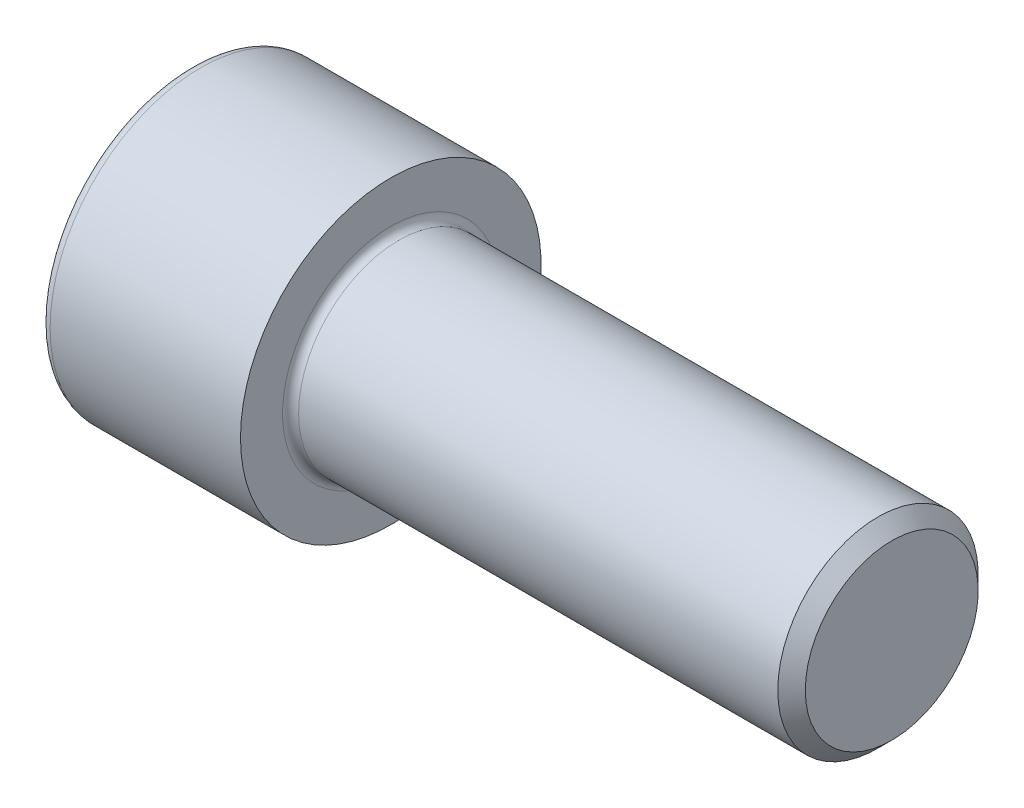
ISO-10303-21;
HEADER;
FILE_DESCRIPTION(('STEP AP214'),'2;1');
FILE_NAME('part.step','',(''),(''),'','','');
FILE_SCHEMA(('AUTOMOTIVE_DESIGN { 1 0 10303 214 1 1 1 1 }'));
ENDSEC;
DATA;
#1=APPLICATION_CONTEXT('core data for automotive mechanical design processes');
#2=APPLICATION_PROTOCOL_DEFINITION('international standard','automotive_design',2000,#1);
#3=PRODUCT_CONTEXT('',#1,'mechanical');
#4=PRODUCT('Part','Part','',(#3));
#5=PRODUCT_RELATED_PRODUCT_CATEGORY('part','',(#4));
#6=PRODUCT_DEFINITION_FORMATION('','',#4);
#7=PRODUCT_DEFINITION_CONTEXT('part definition',#1,'design');
#8=PRODUCT_DEFINITION('design','',#6,#7);
#9=PRODUCT_DEFINITION_SHAPE('','',#8);
#10=(LENGTH_UNIT() NAMED_UNIT(*) SI_UNIT(.MILLI.,.METRE.));
#11=(NAMED_UNIT(*) PLANE_ANGLE_UNIT() SI_UNIT($,.RADIAN.));
#12=(NAMED_UNIT(*) SI_UNIT($,.STERADIAN.) SOLID_ANGLE_UNIT());
#13=UNCERTAINTY_MEASURE_WITH_UNIT(LENGTH_MEASURE(1.E-05),#10,'distance_accuracy_value','');
#14=(GEOMETRIC_REPRESENTATION_CONTEXT(3) GLOBAL_UNCERTAINTY_ASSIGNED_CONTEXT((#13)) GLOBAL_UNIT_ASSIGNED_CONTEXT((#10,
#11,#12)) REPRESENTATION_CONTEXT('',''));
#15=CARTESIAN_POINT('',(0.,0.,0.));
#16=DIRECTION('',(0.,0.,1.));
#17=DIRECTION('',(1.,0.,0.));
#18=AXIS2_PLACEMENT_3D('',#15,#16,#17);
#19=CARTESIAN_POINT('',(0.,0.,0.));
#20=DIRECTION('',(-1.,0.,0.));
#21=DIRECTION('',(0.,0.,1.));
#22=AXIS2_PLACEMENT_3D('',#19,#20,#21);
#23=PLANE('',#22);
#24=DIRECTION('',(0.,-0.499999999999999,0.866025403784439));
#25=VECTOR('',#24,1.);
#26=CARTESIAN_POINT('',(0.,9.94774513813725,0.));
#27=LINE('',#26,#25);
#28=CARTESIAN_POINT('',(0.,9.94774513813725,0.));
#29=VERTEX_POINT('',#28);
#30=CARTESIAN_POINT('',(0.,4.97387256906863,8.61499999999999));
#31=VERTEX_POINT('',#30);
#32=EDGE_CURVE('E259',#29,#31,#27,.T.);
#33=ORIENTED_EDGE('',*,*,#32,.T.);
#34=DIRECTION('',(0.,1.,0.));
#35=VECTOR('',#34,1.);
#36=CARTESIAN_POINT('',(0.,-4.97387256906862,8.615));
#37=LINE('',#36,#35);
#38=CARTESIAN_POINT('',(0.,-4.97387256906862,8.615));
#39=VERTEX_POINT('',#38);
#40=EDGE_CURVE('E131',#39,#31,#37,.T.);
#41=ORIENTED_EDGE('',*,*,#40,.F.);
#42=DIRECTION('',(0.,-0.500000000000001,-0.866025403784438));
#43=VECTOR('',#42,1.);
#44=CARTESIAN_POINT('',(0.,-4.97387256906862,8.615));
#45=LINE('',#44,#43);
#46=CARTESIAN_POINT('',(0.,-9.94774513813725,0.));
#47=VERTEX_POINT('',#46);
#48=EDGE_CURVE('E262',#39,#47,#45,.T.);
#49=ORIENTED_EDGE('',*,*,#48,.T.);
#50=DIRECTION('',(0.,0.499999999999999,-0.866025403784439));
#51=VECTOR('',#50,1.);
#52=CARTESIAN_POINT('',(0.,-9.94774513813725,0.));
#53=LINE('',#52,#51);
#54=CARTESIAN_POINT('',(0.,-4.97387256906864,-8.615));
#55=VERTEX_POINT('',#54);
#56=EDGE_CURVE('E265',#47,#55,#53,.T.);
#57=ORIENTED_EDGE('',*,*,#56,.T.);
#58=DIRECTION('',(0.,-1.,0.));
#59=VECTOR('',#58,1.);
#60=CARTESIAN_POINT('',(0.,4.97387256906861,-8.61500000000001));
#61=LINE('',#60,#59);
#62=CARTESIAN_POINT('',(0.,4.97387256906861,-8.61500000000001));
#63=VERTEX_POINT('',#62);
#64=EDGE_CURVE('E268',#63,#55,#61,.T.);
#65=ORIENTED_EDGE('',*,*,#64,.F.);
#66=DIRECTION('',(0.,-0.500000000000001,-0.866025403784438));
#67=VECTOR('',#66,1.);
#68=CARTESIAN_POINT('',(0.,9.94774513813725,0.));
#69=LINE('',#68,#67);
#70=EDGE_CURVE('E126',#29,#63,#69,.T.);
#71=ORIENTED_EDGE('',*,*,#70,.F.);
#72=EDGE_LOOP('',(#33,#41,#49,#57,#65,#71));
#73=FACE_BOUND('',#72,.T.);
#74=CARTESIAN_POINT('',(0.,0.,0.));
#75=DIRECTION('',(-1.,0.,0.));
#76=DIRECTION('',(0.,0.,1.));
#77=AXIS2_PLACEMENT_3D('',#74,#75,#76);
#78=CIRCLE('',#77,14.);
#79=CARTESIAN_POINT('',(0.,0.,14.));
#80=VERTEX_POINT('',#79);
#81=EDGE_CURVE('E43',#80,#80,#78,.T.);
#82=ORIENTED_EDGE('',*,*,#81,.T.);
#83=EDGE_LOOP('',(#82));
#84=FACE_BOUND('',#83,.T.);
#85=ADVANCED_FACE('F35',(#73,#84),#23,.T.);
#86=CARTESIAN_POINT('',(-31.75,0.,0.));
#87=DIRECTION('',(-1.,0.,0.));
#88=DIRECTION('',(0.,0.,1.));
#89=AXIS2_PLACEMENT_3D('',#86,#87,#88);
#90=CYLINDRICAL_SURFACE('',#89,15.);
#91=CARTESIAN_POINT('',(1.,0.,0.));
#92=DIRECTION('',(-1.,0.,0.));
#93=DIRECTION('',(0.,0.,1.));
#94=AXIS2_PLACEMENT_3D('',#91,#92,#93);
#95=CIRCLE('',#94,15.);
#96=CARTESIAN_POINT('',(1.,0.,15.));
#97=VERTEX_POINT('',#96);
#98=EDGE_CURVE('E11',#97,#97,#95,.F.);
#99=ORIENTED_EDGE('',*,*,#98,.T.);
#100=EDGE_LOOP('',(#99));
#101=FACE_BOUND('',#100,.T.);
#102=CARTESIAN_POINT('',(20.,0.,0.));
#103=DIRECTION('',(-1.,0.,0.));
#104=DIRECTION('',(0.,0.,1.));
#105=AXIS2_PLACEMENT_3D('',#102,#103,#104);
#106=CIRCLE('',#105,15.);
#107=CARTESIAN_POINT('',(20.,0.,15.));
#108=VERTEX_POINT('',#107);
#109=EDGE_CURVE('E149',#108,#108,#106,.T.);
#110=ORIENTED_EDGE('',*,*,#109,.T.);
#111=EDGE_LOOP('',(#110));
#112=FACE_BOUND('',#111,.T.);
#113=ADVANCED_FACE('F173',(#101,#112),#90,.T.);
#114=CARTESIAN_POINT('',(20.,15.,0.));
#115=DIRECTION('',(1.,0.,0.));
#116=DIRECTION('',(0.,0.,-1.));
#117=AXIS2_PLACEMENT_3D('',#114,#115,#116);
#118=PLANE('',#117);
#119=CARTESIAN_POINT('',(20.,0.,0.));
#120=DIRECTION('',(1.,0.,0.));
#121=DIRECTION('',(0.,0.,-1.));
#122=AXIS2_PLACEMENT_3D('',#119,#120,#121);
#123=CIRCLE('',#122,10.7999999999999);
#124=CARTESIAN_POINT('',(20.,0.,-10.7999999999999));
#125=VERTEX_POINT('',#124);
#126=EDGE_CURVE('E152',#125,#125,#123,.F.);
#127=ORIENTED_EDGE('',*,*,#126,.T.);
#128=EDGE_LOOP('',(#127));
#129=FACE_BOUND('',#128,.T.);
#130=ORIENTED_EDGE('',*,*,#109,.F.);
#131=EDGE_LOOP('',(#130));
#132=FACE_BOUND('',#131,.T.);
#133=ADVANCED_FACE('F179',(#129,#132),#118,.T.);
#134=CARTESIAN_POINT('',(-31.75,0.,0.));
#135=DIRECTION('',(-1.,0.,0.));
#136=DIRECTION('',(0.,0.,1.));
#137=AXIS2_PLACEMENT_3D('',#134,#135,#136);
#138=CYLINDRICAL_SURFACE('',#137,9.99999999999993);
#139=CARTESIAN_POINT('',(20.8,0.,0.));
#140=DIRECTION('',(1.,0.,0.));
#141=DIRECTION('',(0.,0.,-1.));
#142=AXIS2_PLACEMENT_3D('',#139,#140,#141);
#143=CIRCLE('',#142,9.99999999999993);
#144=CARTESIAN_POINT('',(20.8,0.,-9.99999999999993));
#145=VERTEX_POINT('',#144);
#146=EDGE_CURVE('E155',#145,#145,#143,.T.);
#147=ORIENTED_EDGE('',*,*,#146,.T.);
#148=EDGE_LOOP('',(#147));
#149=FACE_BOUND('',#148,.T.);
#150=CARTESIAN_POINT('',(68.6259999999999,0.,0.));
#151=DIRECTION('',(-1.,0.,0.));
#152=DIRECTION('',(0.,0.,1.));
#153=AXIS2_PLACEMENT_3D('',#150,#151,#152);
#154=CIRCLE('',#153,9.99999999999985);
#155=CARTESIAN_POINT('',(68.6259999999999,0.,9.99999999999985));
#156=VERTEX_POINT('',#155);
#157=EDGE_CURVE('E146',#156,#156,#154,.T.);
#158=ORIENTED_EDGE('',*,*,#157,.T.);
#159=EDGE_LOOP('',(#158));
#160=FACE_BOUND('',#159,.T.);
#161=ADVANCED_FACE('F185',(#149,#160),#138,.T.);
#162=CARTESIAN_POINT('',(70.,0.,0.));
#163=DIRECTION('',(-1.,0.,0.));
#164=DIRECTION('',(0.,0.,1.));
#165=AXIS2_PLACEMENT_3D('',#162,#163,#164);
#166=CONICAL_SURFACE('',#165,8.626,0.785398163397358);
#167=ORIENTED_EDGE('',*,*,#157,.F.);
#168=EDGE_LOOP('',(#167));
#169=FACE_BOUND('',#168,.T.);
#170=CARTESIAN_POINT('',(70.,0.,0.));
#171=DIRECTION('',(-1.,0.,0.));
#172=DIRECTION('',(0.,0.,1.));
#173=AXIS2_PLACEMENT_3D('',#170,#171,#172);
#174=CIRCLE('',#173,8.626);
#175=CARTESIAN_POINT('',(70.,0.,8.626));
#176=VERTEX_POINT('',#175);
#177=EDGE_CURVE('E142',#176,#176,#174,.T.);
#178=ORIENTED_EDGE('',*,*,#177,.T.);
#179=EDGE_LOOP('',(#178));
#180=FACE_BOUND('',#179,.T.);
#181=ADVANCED_FACE('F189',(#169,#180),#166,.T.);
#182=CARTESIAN_POINT('',(70.,8.626,0.));
#183=DIRECTION('',(1.,0.,0.));
#184=DIRECTION('',(0.,0.,-1.));
#185=AXIS2_PLACEMENT_3D('',#182,#183,#184);
#186=PLANE('',#185);
#187=ORIENTED_EDGE('',*,*,#177,.F.);
#188=EDGE_LOOP('',(#187));
#189=FACE_BOUND('',#188,.T.);
#190=ADVANCED_FACE('F169',(#189),#186,.T.);
#191=CARTESIAN_POINT('',(20.8,0.,0.));
#192=DIRECTION('',(1.,0.,0.));
#193=DIRECTION('',(0.,0.,-1.));
#194=AXIS2_PLACEMENT_3D('',#191,#192,#193);
#195=TOROIDAL_SURFACE('',#194,10.7999999999999,0.8);
#196=ORIENTED_EDGE('',*,*,#146,.F.);
#197=EDGE_LOOP('',(#196));
#198=FACE_BOUND('',#197,.T.);
#199=ORIENTED_EDGE('',*,*,#126,.F.);
#200=EDGE_LOOP('',(#199));
#201=FACE_BOUND('',#200,.T.);
#202=ADVANCED_FACE('F162',(#198,#201),#195,.F.);
#203=CARTESIAN_POINT('',(1.,0.,0.));
#204=DIRECTION('',(-1.,0.,0.));
#205=DIRECTION('',(0.,0.,1.));
#206=AXIS2_PLACEMENT_3D('',#203,#204,#205);
#207=TOROIDAL_SURFACE('',#206,14.,1.);
#208=ORIENTED_EDGE('',*,*,#98,.F.);
#209=EDGE_LOOP('',(#208));
#210=FACE_BOUND('',#209,.T.);
#211=ORIENTED_EDGE('',*,*,#81,.F.);
#212=EDGE_LOOP('',(#211));
#213=FACE_BOUND('',#212,.T.);
#214=ADVANCED_FACE('F37',(#210,#213),#207,.T.);
#215=CARTESIAN_POINT('',(10.,9.94774513813725,0.));
#216=DIRECTION('',(0.,-0.866025403784439,-0.499999999999999));
#217=DIRECTION('',(0.,0.499999999999999,-0.866025403784439));
#218=AXIS2_PLACEMENT_3D('',#215,#216,#217);
#219=PLANE('',#218);
#220=ORIENTED_EDGE('',*,*,#32,.F.);
#221=DIRECTION('',(-1.,0.,0.));
#222=VECTOR('',#221,1.);
#223=CARTESIAN_POINT('',(10.,9.94774513813725,0.));
#224=LINE('',#223,#222);
#225=CARTESIAN_POINT('',(10.,9.94774513813725,0.));
#226=VERTEX_POINT('',#225);
#227=EDGE_CURVE('E249',#226,#29,#224,.T.);
#228=ORIENTED_EDGE('',*,*,#227,.F.);
#229=DIRECTION('',(0.,-0.499999999999999,0.866025403784439));
#230=VECTOR('',#229,1.);
#231=CARTESIAN_POINT('',(10.,9.94774513813725,0.));
#232=LINE('',#231,#230);
#233=CARTESIAN_POINT('',(10.,7.46080885360294,4.30749999999999));
#234=VERTEX_POINT('',#233);
#235=EDGE_CURVE('E118',#226,#234,#232,.T.);
#236=ORIENTED_EDGE('',*,*,#235,.T.);
#237=CARTESIAN_POINT('',(10.,4.97387256906863,8.61499999999999));
#238=VERTEX_POINT('',#237);
#239=EDGE_CURVE('E109',#234,#238,#232,.T.);
#240=ORIENTED_EDGE('',*,*,#239,.T.);
#241=DIRECTION('',(-1.,0.,0.));
#242=VECTOR('',#241,1.);
#243=CARTESIAN_POINT('',(10.,4.97387256906863,8.61499999999999));
#244=LINE('',#243,#242);
#245=EDGE_CURVE('E123',#238,#31,#244,.T.);
#246=ORIENTED_EDGE('',*,*,#245,.T.);
#247=EDGE_LOOP('',(#220,#228,#236,#240,#246));
#248=FACE_BOUND('',#247,.T.);
#249=ADVANCED_FACE('F122',(#248),#219,.T.);
#250=CARTESIAN_POINT('',(10.,-4.97387256906862,8.615));
#251=DIRECTION('',(0.,0.,1.));
#252=DIRECTION('',(0.,-1.,0.));
#253=AXIS2_PLACEMENT_3D('',#250,#251,#252);
#254=PLANE('',#253);
#255=ORIENTED_EDGE('',*,*,#40,.T.);
#256=ORIENTED_EDGE('',*,*,#245,.F.);
#257=DIRECTION('',(0.,1.,0.));
#258=VECTOR('',#257,1.);
#259=CARTESIAN_POINT('',(10.,-4.97387256906862,8.615));
#260=LINE('',#259,#258);
#261=CARTESIAN_POINT('',(10.,0.,8.61499999999999));
#262=VERTEX_POINT('',#261);
#263=EDGE_CURVE('E106',#262,#238,#260,.T.);
#264=ORIENTED_EDGE('',*,*,#263,.F.);
#265=CARTESIAN_POINT('',(10.,-4.97387256906862,8.615));
#266=VERTEX_POINT('',#265);
#267=EDGE_CURVE('E117',#266,#262,#260,.T.);
#268=ORIENTED_EDGE('',*,*,#267,.F.);
#269=DIRECTION('',(-1.,0.,0.));
#270=VECTOR('',#269,1.);
#271=CARTESIAN_POINT('',(10.,-4.97387256906862,8.615));
#272=LINE('',#271,#270);
#273=EDGE_CURVE('E133',#266,#39,#272,.T.);
#274=ORIENTED_EDGE('',*,*,#273,.T.);
#275=EDGE_LOOP('',(#255,#256,#264,#268,#274));
#276=FACE_BOUND('',#275,.T.);
#277=ADVANCED_FACE('F128',(#276),#254,.F.);
#278=CARTESIAN_POINT('',(10.,-4.97387256906862,8.615));
#279=DIRECTION('',(0.,0.866025403784438,-0.500000000000001));
#280=DIRECTION('',(0.,0.500000000000001,0.866025403784438));
#281=AXIS2_PLACEMENT_3D('',#278,#279,#280);
#282=PLANE('',#281);
#283=ORIENTED_EDGE('',*,*,#48,.F.);
#284=ORIENTED_EDGE('',*,*,#273,.F.);
#285=DIRECTION('',(0.,-0.500000000000001,-0.866025403784438));
#286=VECTOR('',#285,1.);
#287=CARTESIAN_POINT('',(10.,-4.97387256906862,8.615));
#288=LINE('',#287,#286);
#289=CARTESIAN_POINT('',(10.,-7.46080885360293,4.30750000000001));
#290=VERTEX_POINT('',#289);
#291=EDGE_CURVE('E288',#266,#290,#288,.T.);
#292=ORIENTED_EDGE('',*,*,#291,.T.);
#293=CARTESIAN_POINT('',(10.,-9.94774513813725,0.));
#294=VERTEX_POINT('',#293);
#295=EDGE_CURVE('E277',#290,#294,#288,.T.);
#296=ORIENTED_EDGE('',*,*,#295,.T.);
#297=DIRECTION('',(-1.,0.,0.));
#298=VECTOR('',#297,1.);
#299=CARTESIAN_POINT('',(10.,-9.94774513813725,0.));
#300=LINE('',#299,#298);
#301=EDGE_CURVE('E138',#294,#47,#300,.T.);
#302=ORIENTED_EDGE('',*,*,#301,.T.);
#303=EDGE_LOOP('',(#283,#284,#292,#296,#302));
#304=FACE_BOUND('',#303,.T.);
#305=ADVANCED_FACE('F203',(#304),#282,.T.);
#306=CARTESIAN_POINT('',(10.,-9.94774513813725,0.));
#307=DIRECTION('',(0.,0.866025403784439,0.499999999999999));
#308=DIRECTION('',(0.,-0.499999999999999,0.866025403784439));
#309=AXIS2_PLACEMENT_3D('',#306,#307,#308);
#310=PLANE('',#309);
#311=ORIENTED_EDGE('',*,*,#56,.F.);
#312=ORIENTED_EDGE('',*,*,#301,.F.);
#313=DIRECTION('',(0.,0.499999999999999,-0.866025403784439));
#314=VECTOR('',#313,1.);
#315=CARTESIAN_POINT('',(10.,-9.94774513813725,0.));
#316=LINE('',#315,#314);
#317=CARTESIAN_POINT('',(10.,-7.46080885360295,-4.30749999999999));
#318=VERTEX_POINT('',#317);
#319=EDGE_CURVE('E255',#294,#318,#316,.T.);
#320=ORIENTED_EDGE('',*,*,#319,.T.);
#321=CARTESIAN_POINT('',(10.,-4.97387256906864,-8.615));
#322=VERTEX_POINT('',#321);
#323=EDGE_CURVE('E287',#318,#322,#316,.T.);
#324=ORIENTED_EDGE('',*,*,#323,.T.);
#325=DIRECTION('',(-1.,0.,0.));
#326=VECTOR('',#325,1.);
#327=CARTESIAN_POINT('',(10.,-4.97387256906864,-8.615));
#328=LINE('',#327,#326);
#329=EDGE_CURVE('E248',#322,#55,#328,.T.);
#330=ORIENTED_EDGE('',*,*,#329,.T.);
#331=EDGE_LOOP('',(#311,#312,#320,#324,#330));
#332=FACE_BOUND('',#331,.T.);
#333=ADVANCED_FACE('F206',(#332),#310,.T.);
#334=CARTESIAN_POINT('',(10.,4.97387256906861,-8.61500000000001));
#335=DIRECTION('',(0.,0.,-1.));
#336=DIRECTION('',(0.,1.,0.));
#337=AXIS2_PLACEMENT_3D('',#334,#335,#336);
#338=PLANE('',#337);
#339=ORIENTED_EDGE('',*,*,#64,.T.);
#340=ORIENTED_EDGE('',*,*,#329,.F.);
#341=DIRECTION('',(0.,-1.,0.));
#342=VECTOR('',#341,1.);
#343=CARTESIAN_POINT('',(10.,4.97387256906861,-8.61500000000001));
#344=LINE('',#343,#342);
#345=CARTESIAN_POINT('',(10.,0.,-8.615));
#346=VERTEX_POINT('',#345);
#347=EDGE_CURVE('E252',#346,#322,#344,.T.);
#348=ORIENTED_EDGE('',*,*,#347,.F.);
#349=CARTESIAN_POINT('',(10.,4.97387256906861,-8.61500000000001));
#350=VERTEX_POINT('',#349);
#351=EDGE_CURVE('E50',#350,#346,#344,.T.);
#352=ORIENTED_EDGE('',*,*,#351,.F.);
#353=DIRECTION('',(-1.,0.,0.));
#354=VECTOR('',#353,1.);
#355=CARTESIAN_POINT('',(10.,4.97387256906861,-8.61500000000001));
#356=LINE('',#355,#354);
#357=EDGE_CURVE('E245',#350,#63,#356,.T.);
#358=ORIENTED_EDGE('',*,*,#357,.T.);
#359=EDGE_LOOP('',(#339,#340,#348,#352,#358));
#360=FACE_BOUND('',#359,.T.);
#361=ADVANCED_FACE('F210',(#360),#338,.F.);
#362=CARTESIAN_POINT('',(10.,9.94774513813725,0.));
#363=DIRECTION('',(0.,0.866025403784438,-0.500000000000001));
#364=DIRECTION('',(0.,0.500000000000001,0.866025403784438));
#365=AXIS2_PLACEMENT_3D('',#362,#363,#364);
#366=PLANE('',#365);
#367=ORIENTED_EDGE('',*,*,#70,.T.);
#368=ORIENTED_EDGE('',*,*,#357,.F.);
#369=DIRECTION('',(0.,-0.500000000000001,-0.866025403784438));
#370=VECTOR('',#369,1.);
#371=CARTESIAN_POINT('',(10.,9.94774513813725,0.));
#372=LINE('',#371,#370);
#373=CARTESIAN_POINT('',(10.,7.46080885360293,-4.30750000000001));
#374=VERTEX_POINT('',#373);
#375=EDGE_CURVE('E235',#374,#350,#372,.T.);
#376=ORIENTED_EDGE('',*,*,#375,.F.);
#377=EDGE_CURVE('E241',#226,#374,#372,.T.);
#378=ORIENTED_EDGE('',*,*,#377,.F.);
#379=ORIENTED_EDGE('',*,*,#227,.T.);
#380=EDGE_LOOP('',(#367,#368,#376,#378,#379));
#381=FACE_BOUND('',#380,.T.);
#382=ADVANCED_FACE('F214',(#381),#366,.F.);
#383=CARTESIAN_POINT('',(10.,9.94774513813725,0.));
#384=DIRECTION('',(1.,0.,0.));
#385=DIRECTION('',(0.,0.,-1.));
#386=AXIS2_PLACEMENT_3D('',#383,#384,#385);
#387=PLANE('',#386);
#388=ORIENTED_EDGE('',*,*,#347,.T.);
#389=ORIENTED_EDGE('',*,*,#323,.F.);
#390=CARTESIAN_POINT('',(10.,0.,0.));
#391=DIRECTION('',(-1.,0.,0.));
#392=DIRECTION('',(0.,0.,1.));
#393=AXIS2_PLACEMENT_3D('',#390,#391,#392);
#394=CIRCLE('',#393,8.615);
#395=EDGE_CURVE('E283',#346,#318,#394,.T.);
#396=ORIENTED_EDGE('',*,*,#395,.F.);
#397=EDGE_LOOP('',(#388,#389,#396));
#398=FACE_BOUND('',#397,.T.);
#399=ADVANCED_FACE('F218',(#398),#387,.F.);
#400=ORIENTED_EDGE('',*,*,#319,.F.);
#401=ORIENTED_EDGE('',*,*,#295,.F.);
#402=EDGE_CURVE('E136',#318,#290,#394,.T.);
#403=ORIENTED_EDGE('',*,*,#402,.F.);
#404=EDGE_LOOP('',(#400,#401,#403));
#405=FACE_BOUND('',#404,.T.);
#406=ADVANCED_FACE('F221',(#405),#387,.F.);
#407=ORIENTED_EDGE('',*,*,#291,.F.);
#408=ORIENTED_EDGE('',*,*,#267,.T.);
#409=EDGE_CURVE('E132',#290,#262,#394,.T.);
#410=ORIENTED_EDGE('',*,*,#409,.F.);
#411=EDGE_LOOP('',(#407,#408,#410));
#412=FACE_BOUND('',#411,.T.);
#413=ADVANCED_FACE('F226',(#412),#387,.F.);
#414=ORIENTED_EDGE('',*,*,#263,.T.);
#415=ORIENTED_EDGE('',*,*,#239,.F.);
#416=EDGE_CURVE('E112',#262,#234,#394,.T.);
#417=ORIENTED_EDGE('',*,*,#416,.F.);
#418=EDGE_LOOP('',(#414,#415,#417));
#419=FACE_BOUND('',#418,.T.);
#420=ADVANCED_FACE('F108',(#419),#387,.F.);
#421=ORIENTED_EDGE('',*,*,#235,.F.);
#422=ORIENTED_EDGE('',*,*,#377,.T.);
#423=EDGE_CURVE('E143',#234,#374,#394,.T.);
#424=ORIENTED_EDGE('',*,*,#423,.F.);
#425=EDGE_LOOP('',(#421,#422,#424));
#426=FACE_BOUND('',#425,.T.);
#427=ADVANCED_FACE('F229',(#426),#387,.F.);
#428=ORIENTED_EDGE('',*,*,#375,.T.);
#429=ORIENTED_EDGE('',*,*,#351,.T.);
#430=EDGE_CURVE('E238',#374,#346,#394,.T.);
#431=ORIENTED_EDGE('',*,*,#430,.F.);
#432=EDGE_LOOP('',(#428,#429,#431));
#433=FACE_BOUND('',#432,.T.);
#434=ADVANCED_FACE('F199',(#433),#387,.F.);
#435=CARTESIAN_POINT('',(10.,0.,0.));
#436=DIRECTION('',(-1.,0.,0.));
#437=DIRECTION('',(0.,0.,1.));
#438=AXIS2_PLACEMENT_3D('',#435,#436,#437);
#439=CONICAL_SURFACE('',#438,8.615,1.04719755119659);
#440=CARTESIAN_POINT('',(14.9738725690687,0.,0.));
#441=VERTEX_POINT('',#440);
#442=VERTEX_LOOP('',#441);
#443=FACE_BOUND('',#442,.T.);
#444=ORIENTED_EDGE('',*,*,#416,.T.);
#445=ORIENTED_EDGE('',*,*,#423,.T.);
#446=ORIENTED_EDGE('',*,*,#430,.T.);
#447=ORIENTED_EDGE('',*,*,#395,.T.);
#448=ORIENTED_EDGE('',*,*,#402,.T.);
#449=ORIENTED_EDGE('',*,*,#409,.T.);
#450=EDGE_LOOP('',(#444,#445,#446,#447,#448,#449));
#451=FACE_BOUND('',#450,.T.);
#452=ADVANCED_FACE('F197',(#443,#451),#439,.F.);
#453=CLOSED_SHELL('',(#85,#113,#133,#161,#181,#190,#202,#214,#249,#277,#305,#333,#361,#382,#399,
#406,#413,#420,#427,#434,#452));
#454=MANIFOLD_SOLID_BREP('B2',#453);
#455=ADVANCED_BREP_SHAPE_REPRESENTATION('',(#18,#454),#14);
#456=SHAPE_DEFINITION_REPRESENTATION(#9,#455);
ENDSEC;
END-ISO-10303-21;
